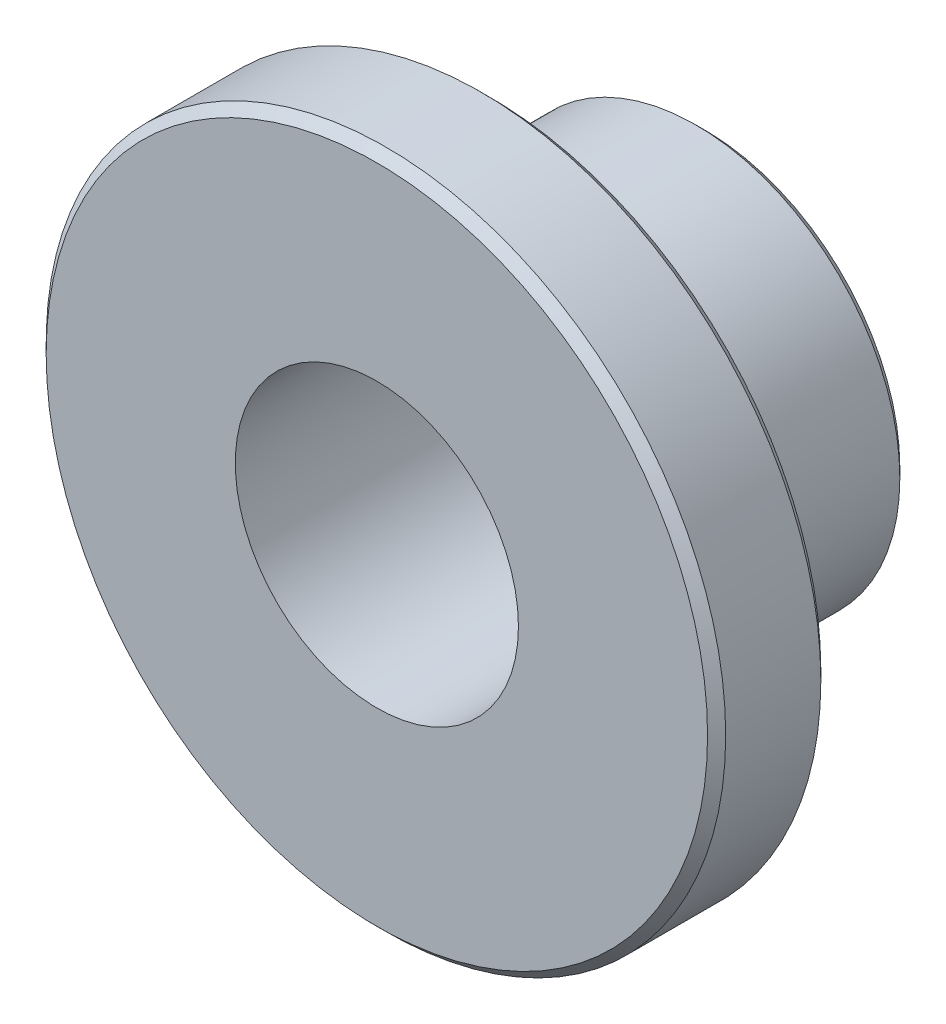
ISO-10303-21;
HEADER;
FILE_DESCRIPTION(('STEP AP214'),'2;1');
FILE_NAME('part.step','',(''),(''),'','','');
FILE_SCHEMA(('AUTOMOTIVE_DESIGN { 1 0 10303 214 1 1 1 1 }'));
ENDSEC;
DATA;
#1=APPLICATION_CONTEXT('core data for automotive mechanical design processes');
#2=APPLICATION_PROTOCOL_DEFINITION('international standard','automotive_design',2000,#1);
#3=PRODUCT_CONTEXT('',#1,'mechanical');
#4=PRODUCT('Part','Part','',(#3));
#5=PRODUCT_RELATED_PRODUCT_CATEGORY('part','',(#4));
#6=PRODUCT_DEFINITION_FORMATION('','',#4);
#7=PRODUCT_DEFINITION_CONTEXT('part definition',#1,'design');
#8=PRODUCT_DEFINITION('design','',#6,#7);
#9=PRODUCT_DEFINITION_SHAPE('','',#8);
#10=(LENGTH_UNIT() NAMED_UNIT(*) SI_UNIT(.MILLI.,.METRE.));
#11=(NAMED_UNIT(*) PLANE_ANGLE_UNIT() SI_UNIT($,.RADIAN.));
#12=(NAMED_UNIT(*) SI_UNIT($,.STERADIAN.) SOLID_ANGLE_UNIT());
#13=UNCERTAINTY_MEASURE_WITH_UNIT(LENGTH_MEASURE(1.E-05),#10,'distance_accuracy_value','');
#14=(GEOMETRIC_REPRESENTATION_CONTEXT(3) GLOBAL_UNCERTAINTY_ASSIGNED_CONTEXT((#13)) GLOBAL_UNIT_ASSIGNED_CONTEXT((#10,
#11,#12)) REPRESENTATION_CONTEXT('',''));
#15=CARTESIAN_POINT('',(0.,0.,0.));
#16=DIRECTION('',(0.,0.,1.));
#17=DIRECTION('',(1.,0.,0.));
#18=AXIS2_PLACEMENT_3D('',#15,#16,#17);
#19=CARTESIAN_POINT('',(0.,0.,4.6));
#20=DIRECTION('',(0.,0.,-1.));
#21=DIRECTION('',(-1.,0.,0.));
#22=AXIS2_PLACEMENT_3D('',#19,#20,#21);
#23=CYLINDRICAL_SURFACE('',#22,5.715);
#24=CARTESIAN_POINT('',(0.,0.,-4.346));
#25=DIRECTION('',(0.,0.,1.));
#26=DIRECTION('',(1.,0.,0.));
#27=AXIS2_PLACEMENT_3D('',#24,#25,#26);
#28=CIRCLE('',#27,5.715);
#29=CARTESIAN_POINT('',(5.715,0.,-4.346));
#30=VERTEX_POINT('',#29);
#31=EDGE_CURVE('E44',#30,#30,#28,.T.);
#32=ORIENTED_EDGE('',*,*,#31,.T.);
#33=EDGE_LOOP('',(#32));
#34=FACE_BOUND('',#33,.T.);
#35=CARTESIAN_POINT('',(0.,0.,1.425));
#36=DIRECTION('',(0.,0.,1.));
#37=DIRECTION('',(1.,0.,0.));
#38=AXIS2_PLACEMENT_3D('',#35,#36,#37);
#39=CIRCLE('',#38,5.715);
#40=CARTESIAN_POINT('',(5.715,0.,1.425));
#41=VERTEX_POINT('',#40);
#42=EDGE_CURVE('E59',#41,#41,#39,.T.);
#43=ORIENTED_EDGE('',*,*,#42,.F.);
#44=EDGE_LOOP('',(#43));
#45=FACE_BOUND('',#44,.T.);
#46=ADVANCED_FACE('F33',(#34,#45),#23,.T.);
#47=CARTESIAN_POINT('',(0.,0.,4.6));
#48=DIRECTION('',(0.,0.,1.));
#49=DIRECTION('',(1.,0.,0.));
#50=AXIS2_PLACEMENT_3D('',#47,#48,#49);
#51=PLANE('',#50);
#52=CARTESIAN_POINT('',(0.,0.,4.6));
#53=DIRECTION('',(0.,0.,1.));
#54=DIRECTION('',(1.,0.,0.));
#55=AXIS2_PLACEMENT_3D('',#52,#53,#54);
#56=CIRCLE('',#55,9.271);
#57=CARTESIAN_POINT('',(9.271,0.,4.6));
#58=VERTEX_POINT('',#57);
#59=EDGE_CURVE('E10',#58,#58,#56,.T.);
#60=ORIENTED_EDGE('',*,*,#59,.T.);
#61=EDGE_LOOP('',(#60));
#62=FACE_BOUND('',#61,.T.);
#63=CARTESIAN_POINT('',(0.,0.,4.6));
#64=DIRECTION('',(0.,0.,1.));
#65=DIRECTION('',(1.,0.,0.));
#66=AXIS2_PLACEMENT_3D('',#63,#64,#65);
#67=CIRCLE('',#66,3.96875);
#68=CARTESIAN_POINT('',(3.96875,0.,4.6));
#69=VERTEX_POINT('',#68);
#70=EDGE_CURVE('E62',#69,#69,#67,.T.);
#71=ORIENTED_EDGE('',*,*,#70,.F.);
#72=EDGE_LOOP('',(#71));
#73=FACE_BOUND('',#72,.T.);
#74=ADVANCED_FACE('F72',(#62,#73),#51,.T.);
#75=CARTESIAN_POINT('',(0.,0.,-4.6));
#76=DIRECTION('',(0.,0.,1.));
#77=DIRECTION('',(1.,0.,0.));
#78=AXIS2_PLACEMENT_3D('',#75,#76,#77);
#79=PLANE('',#78);
#80=CARTESIAN_POINT('',(0.,0.,-4.6));
#81=DIRECTION('',(0.,0.,1.));
#82=DIRECTION('',(1.,0.,0.));
#83=AXIS2_PLACEMENT_3D('',#80,#81,#82);
#84=CIRCLE('',#83,5.461);
#85=CARTESIAN_POINT('',(5.461,0.,-4.6));
#86=VERTEX_POINT('',#85);
#87=EDGE_CURVE('E40',#86,#86,#84,.F.);
#88=ORIENTED_EDGE('',*,*,#87,.T.);
#89=EDGE_LOOP('',(#88));
#90=FACE_BOUND('',#89,.T.);
#91=CARTESIAN_POINT('',(0.,0.,-4.6));
#92=DIRECTION('',(0.,0.,1.));
#93=DIRECTION('',(1.,0.,0.));
#94=AXIS2_PLACEMENT_3D('',#91,#92,#93);
#95=CIRCLE('',#94,3.96875);
#96=CARTESIAN_POINT('',(3.96875,0.,-4.6));
#97=VERTEX_POINT('',#96);
#98=EDGE_CURVE('E63',#97,#97,#95,.T.);
#99=ORIENTED_EDGE('',*,*,#98,.T.);
#100=EDGE_LOOP('',(#99));
#101=FACE_BOUND('',#100,.T.);
#102=ADVANCED_FACE('F74',(#90,#101),#79,.F.);
#103=CARTESIAN_POINT('',(0.,0.,4.6));
#104=DIRECTION('',(0.,0.,-1.));
#105=DIRECTION('',(-1.,0.,0.));
#106=AXIS2_PLACEMENT_3D('',#103,#104,#105);
#107=CYLINDRICAL_SURFACE('',#106,3.96875);
#108=ORIENTED_EDGE('',*,*,#70,.T.);
#109=EDGE_LOOP('',(#108));
#110=FACE_BOUND('',#109,.T.);
#111=ORIENTED_EDGE('',*,*,#98,.F.);
#112=EDGE_LOOP('',(#111));
#113=FACE_BOUND('',#112,.T.);
#114=ADVANCED_FACE('F69',(#110,#113),#107,.F.);
#115=CARTESIAN_POINT('',(0.,0.,1.425));
#116=DIRECTION('',(0.,0.,1.));
#117=DIRECTION('',(1.,0.,0.));
#118=AXIS2_PLACEMENT_3D('',#115,#116,#117);
#119=CYLINDRICAL_SURFACE('',#118,9.525);
#120=CARTESIAN_POINT('',(0.,0.,1.679));
#121=DIRECTION('',(0.,0.,1.));
#122=DIRECTION('',(1.,0.,0.));
#123=AXIS2_PLACEMENT_3D('',#120,#121,#122);
#124=CIRCLE('',#123,9.525);
#125=CARTESIAN_POINT('',(9.525,0.,1.679));
#126=VERTEX_POINT('',#125);
#127=EDGE_CURVE('E53',#126,#126,#124,.T.);
#128=ORIENTED_EDGE('',*,*,#127,.T.);
#129=EDGE_LOOP('',(#128));
#130=FACE_BOUND('',#129,.T.);
#131=CARTESIAN_POINT('',(0.,0.,4.346));
#132=DIRECTION('',(0.,0.,1.));
#133=DIRECTION('',(1.,0.,0.));
#134=AXIS2_PLACEMENT_3D('',#131,#132,#133);
#135=CIRCLE('',#134,9.525);
#136=CARTESIAN_POINT('',(9.525,0.,4.346));
#137=VERTEX_POINT('',#136);
#138=EDGE_CURVE('E56',#137,#137,#135,.F.);
#139=ORIENTED_EDGE('',*,*,#138,.T.);
#140=EDGE_LOOP('',(#139));
#141=FACE_BOUND('',#140,.T.);
#142=ADVANCED_FACE('F103',(#130,#141),#119,.T.);
#143=CARTESIAN_POINT('',(0.,0.,1.425));
#144=DIRECTION('',(0.,0.,1.));
#145=DIRECTION('',(1.,0.,0.));
#146=AXIS2_PLACEMENT_3D('',#143,#144,#145);
#147=PLANE('',#146);
#148=CARTESIAN_POINT('',(0.,0.,1.425));
#149=DIRECTION('',(0.,0.,1.));
#150=DIRECTION('',(1.,0.,0.));
#151=AXIS2_PLACEMENT_3D('',#148,#149,#150);
#152=CIRCLE('',#151,9.271);
#153=CARTESIAN_POINT('',(9.271,0.,1.425));
#154=VERTEX_POINT('',#153);
#155=EDGE_CURVE('E48',#154,#154,#152,.F.);
#156=ORIENTED_EDGE('',*,*,#155,.T.);
#157=EDGE_LOOP('',(#156));
#158=FACE_BOUND('',#157,.T.);
#159=ORIENTED_EDGE('',*,*,#42,.T.);
#160=EDGE_LOOP('',(#159));
#161=FACE_BOUND('',#160,.T.);
#162=ADVANCED_FACE('F89',(#158,#161),#147,.F.);
#163=CARTESIAN_POINT('',(0.,0.,1.679));
#164=DIRECTION('',(0.,0.,1.));
#165=DIRECTION('',(1.,0.,0.));
#166=AXIS2_PLACEMENT_3D('',#163,#164,#165);
#167=CONICAL_SURFACE('',#166,9.525,0.785398163397445);
#168=ORIENTED_EDGE('',*,*,#155,.F.);
#169=EDGE_LOOP('',(#168));
#170=FACE_BOUND('',#169,.T.);
#171=ORIENTED_EDGE('',*,*,#127,.F.);
#172=EDGE_LOOP('',(#171));
#173=FACE_BOUND('',#172,.T.);
#174=ADVANCED_FACE('F86',(#170,#173),#167,.T.);
#175=CARTESIAN_POINT('',(0.,0.,-4.346));
#176=DIRECTION('',(0.,0.,1.));
#177=DIRECTION('',(1.,0.,0.));
#178=AXIS2_PLACEMENT_3D('',#175,#176,#177);
#179=CONICAL_SURFACE('',#178,5.715,0.785398163397453);
#180=ORIENTED_EDGE('',*,*,#87,.F.);
#181=EDGE_LOOP('',(#180));
#182=FACE_BOUND('',#181,.T.);
#183=ORIENTED_EDGE('',*,*,#31,.F.);
#184=EDGE_LOOP('',(#183));
#185=FACE_BOUND('',#184,.T.);
#186=ADVANCED_FACE('F88',(#182,#185),#179,.T.);
#187=CARTESIAN_POINT('',(0.,0.,4.6));
#188=DIRECTION('',(0.,0.,-1.));
#189=DIRECTION('',(-1.,0.,0.));
#190=AXIS2_PLACEMENT_3D('',#187,#188,#189);
#191=CONICAL_SURFACE('',#190,9.271,0.785398163397452);
#192=ORIENTED_EDGE('',*,*,#138,.F.);
#193=EDGE_LOOP('',(#192));
#194=FACE_BOUND('',#193,.T.);
#195=ORIENTED_EDGE('',*,*,#59,.F.);
#196=EDGE_LOOP('',(#195));
#197=FACE_BOUND('',#196,.T.);
#198=ADVANCED_FACE('F35',(#194,#197),#191,.T.);
#199=CLOSED_SHELL('',(#46,#74,#102,#114,#142,#162,#174,#186,#198));
#200=MANIFOLD_SOLID_BREP('B2',#199);
#201=ADVANCED_BREP_SHAPE_REPRESENTATION('',(#18,#200),#14);
#202=SHAPE_DEFINITION_REPRESENTATION(#9,#201);
ENDSEC;
END-ISO-10303-21;
